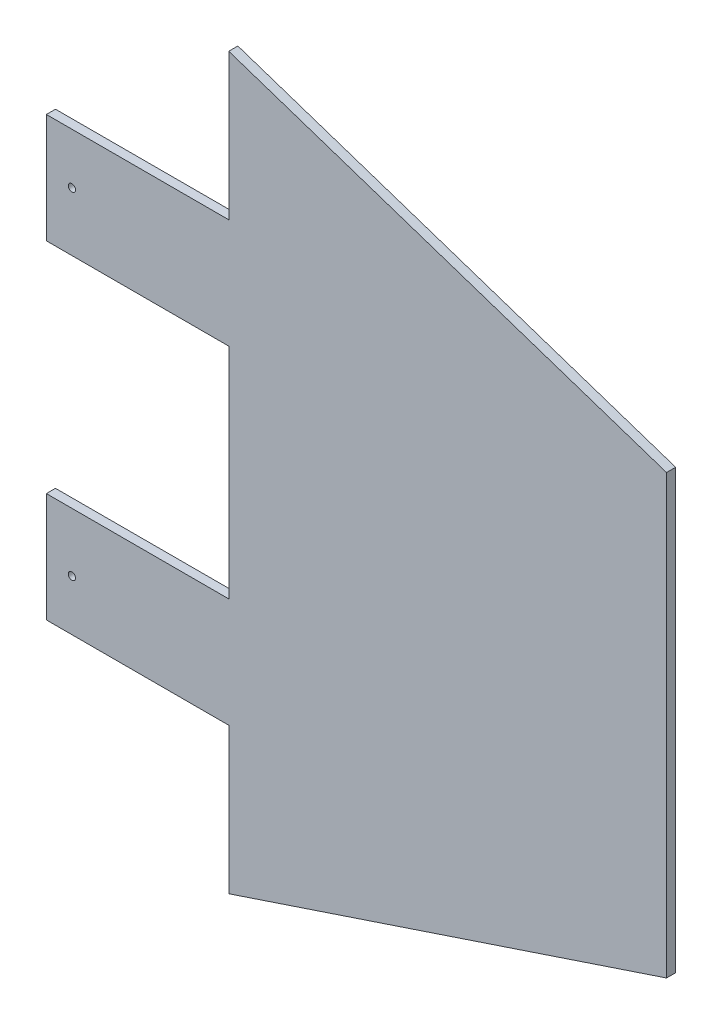
ISO-10303-21;
HEADER;
FILE_DESCRIPTION(('STEP AP214'),'2;1');
FILE_NAME('part.step','',(''),(''),'','','');
FILE_SCHEMA(('AUTOMOTIVE_DESIGN { 1 0 10303 214 1 1 1 1 }'));
ENDSEC;
DATA;
#1=APPLICATION_CONTEXT('core data for automotive mechanical design processes');
#2=APPLICATION_PROTOCOL_DEFINITION('international standard','automotive_design',2000,#1);
#3=PRODUCT_CONTEXT('',#1,'mechanical');
#4=PRODUCT('Part','Part','',(#3));
#5=PRODUCT_RELATED_PRODUCT_CATEGORY('part','',(#4));
#6=PRODUCT_DEFINITION_FORMATION('','',#4);
#7=PRODUCT_DEFINITION_CONTEXT('part definition',#1,'design');
#8=PRODUCT_DEFINITION('design','',#6,#7);
#9=PRODUCT_DEFINITION_SHAPE('','',#8);
#10=(LENGTH_UNIT() NAMED_UNIT(*) SI_UNIT(.MILLI.,.METRE.));
#11=(NAMED_UNIT(*) PLANE_ANGLE_UNIT() SI_UNIT($,.RADIAN.));
#12=(NAMED_UNIT(*) SI_UNIT($,.STERADIAN.) SOLID_ANGLE_UNIT());
#13=UNCERTAINTY_MEASURE_WITH_UNIT(LENGTH_MEASURE(1.E-05),#10,'distance_accuracy_value','');
#14=(GEOMETRIC_REPRESENTATION_CONTEXT(3) GLOBAL_UNCERTAINTY_ASSIGNED_CONTEXT((#13)) GLOBAL_UNIT_ASSIGNED_CONTEXT((#10,
#11,#12)) REPRESENTATION_CONTEXT('',''));
#15=CARTESIAN_POINT('',(0.,0.,0.));
#16=DIRECTION('',(0.,0.,1.));
#17=DIRECTION('',(1.,0.,0.));
#18=AXIS2_PLACEMENT_3D('',#15,#16,#17);
#19=CARTESIAN_POINT('',(0.,0.,-1.5875));
#20=DIRECTION('',(0.,0.,-1.));
#21=DIRECTION('',(-1.,0.,0.));
#22=AXIS2_PLACEMENT_3D('',#19,#20,#21);
#23=PLANE('',#22);
#24=CARTESIAN_POINT('',(40.64,-58.5125803294084,-1.5875));
#25=DIRECTION('',(0.,0.,-1.));
#26=DIRECTION('',(-1.,0.,0.));
#27=AXIS2_PLACEMENT_3D('',#24,#25,#26);
#28=CIRCLE('',#27,1.26619);
#29=CARTESIAN_POINT('',(39.37381,-58.5125803294084,-1.5875));
#30=VERTEX_POINT('',#29);
#31=EDGE_CURVE('E150',#30,#30,#28,.T.);
#32=ORIENTED_EDGE('',*,*,#31,.F.);
#33=EDGE_LOOP('',(#32));
#34=FACE_BOUND('',#33,.T.);
#35=DIRECTION('',(0.,-1.,0.));
#36=VECTOR('',#35,1.);
#37=CARTESIAN_POINT('',(95.2500000000001,127.,-1.5875));
#38=LINE('',#37,#36);
#39=CARTESIAN_POINT('',(95.2500000000001,127.,-1.5875));
#40=VERTEX_POINT('',#39);
#41=CARTESIAN_POINT('',(95.2500000000001,76.2,-1.5875));
#42=VERTEX_POINT('',#41);
#43=EDGE_CURVE('E125',#40,#42,#38,.T.);
#44=ORIENTED_EDGE('',*,*,#43,.F.);
#45=DIRECTION('',(-0.948683298050514,0.316227766016838,0.));
#46=VECTOR('',#45,1.);
#47=CARTESIAN_POINT('',(95.2500000000001,127.,-1.5875));
#48=LINE('',#47,#46);
#49=CARTESIAN_POINT('',(247.65,76.2,-1.5875));
#50=VERTEX_POINT('',#49);
#51=EDGE_CURVE('E130',#50,#40,#48,.T.);
#52=ORIENTED_EDGE('',*,*,#51,.F.);
#53=DIRECTION('',(0.,1.,0.));
#54=VECTOR('',#53,1.);
#55=CARTESIAN_POINT('',(247.65,76.2,-1.5875));
#56=LINE('',#55,#54);
#57=CARTESIAN_POINT('',(247.65,-76.2,-1.5875));
#58=VERTEX_POINT('',#57);
#59=EDGE_CURVE('E205',#58,#50,#56,.T.);
#60=ORIENTED_EDGE('',*,*,#59,.F.);
#61=DIRECTION('',(0.948683298050514,0.316227766016838,0.));
#62=VECTOR('',#61,1.);
#63=CARTESIAN_POINT('',(95.2500000000001,-127.,-1.5875));
#64=LINE('',#63,#62);
#65=CARTESIAN_POINT('',(95.2500000000001,-127.,-1.5875));
#66=VERTEX_POINT('',#65);
#67=EDGE_CURVE('E202',#66,#58,#64,.T.);
#68=ORIENTED_EDGE('',*,*,#67,.F.);
#69=DIRECTION('',(0.,-1.,0.));
#70=VECTOR('',#69,1.);
#71=CARTESIAN_POINT('',(95.2500000000001,-127.,-1.5875));
#72=LINE('',#71,#70);
#73=CARTESIAN_POINT('',(95.2500000000001,-76.2,-1.5875));
#74=VERTEX_POINT('',#73);
#75=EDGE_CURVE('E199',#74,#66,#72,.T.);
#76=ORIENTED_EDGE('',*,*,#75,.F.);
#77=DIRECTION('',(1.,0.,0.));
#78=VECTOR('',#77,1.);
#79=CARTESIAN_POINT('',(95.2500000000001,-76.2,-1.5875));
#80=LINE('',#79,#78);
#81=CARTESIAN_POINT('',(31.75,-76.2,-1.5875));
#82=VERTEX_POINT('',#81);
#83=EDGE_CURVE('E196',#82,#74,#80,.T.);
#84=ORIENTED_EDGE('',*,*,#83,.F.);
#85=DIRECTION('',(0.,-1.,0.));
#86=VECTOR('',#85,1.);
#87=CARTESIAN_POINT('',(31.75,-76.2,-1.5875));
#88=LINE('',#87,#86);
#89=CARTESIAN_POINT('',(31.75,-38.1,-1.5875));
#90=VERTEX_POINT('',#89);
#91=EDGE_CURVE('E193',#90,#82,#88,.T.);
#92=ORIENTED_EDGE('',*,*,#91,.F.);
#93=DIRECTION('',(-1.,0.,0.));
#94=VECTOR('',#93,1.);
#95=CARTESIAN_POINT('',(31.75,-38.1,-1.5875));
#96=LINE('',#95,#94);
#97=CARTESIAN_POINT('',(95.25,-38.1,-1.5875));
#98=VERTEX_POINT('',#97);
#99=EDGE_CURVE('E190',#98,#90,#96,.T.);
#100=ORIENTED_EDGE('',*,*,#99,.F.);
#101=DIRECTION('',(0.,-1.,0.));
#102=VECTOR('',#101,1.);
#103=CARTESIAN_POINT('',(95.25,38.1,-1.5875));
#104=LINE('',#103,#102);
#105=CARTESIAN_POINT('',(95.25,38.1,-1.5875));
#106=VERTEX_POINT('',#105);
#107=EDGE_CURVE('E187',#106,#98,#104,.T.);
#108=ORIENTED_EDGE('',*,*,#107,.F.);
#109=DIRECTION('',(1.,0.,0.));
#110=VECTOR('',#109,1.);
#111=CARTESIAN_POINT('',(31.75,38.1,-1.5875));
#112=LINE('',#111,#110);
#113=CARTESIAN_POINT('',(31.75,38.1,-1.5875));
#114=VERTEX_POINT('',#113);
#115=EDGE_CURVE('E184',#114,#106,#112,.T.);
#116=ORIENTED_EDGE('',*,*,#115,.F.);
#117=DIRECTION('',(0.,-1.,0.));
#118=VECTOR('',#117,1.);
#119=CARTESIAN_POINT('',(31.75,76.2,-1.5875));
#120=LINE('',#119,#118);
#121=CARTESIAN_POINT('',(31.75,76.2,-1.5875));
#122=VERTEX_POINT('',#121);
#123=EDGE_CURVE('E181',#122,#114,#120,.T.);
#124=ORIENTED_EDGE('',*,*,#123,.F.);
#125=DIRECTION('',(-1.,0.,0.));
#126=VECTOR('',#125,1.);
#127=CARTESIAN_POINT('',(95.2500000000001,76.2,-1.5875));
#128=LINE('',#127,#126);
#129=EDGE_CURVE('E179',#42,#122,#128,.T.);
#130=ORIENTED_EDGE('',*,*,#129,.F.);
#131=EDGE_LOOP('',(#44,#52,#60,#68,#76,#84,#92,#100,#108,#116,#124,#130));
#132=FACE_BOUND('',#131,.T.);
#133=CARTESIAN_POINT('',(40.64,58.5125803294083,-1.5875));
#134=DIRECTION('',(0.,0.,1.));
#135=DIRECTION('',(1.,0.,0.));
#136=AXIS2_PLACEMENT_3D('',#133,#134,#135);
#137=CIRCLE('',#136,1.26619);
#138=CARTESIAN_POINT('',(41.90619,58.5125803294083,-1.5875));
#139=VERTEX_POINT('',#138);
#140=EDGE_CURVE('E144',#139,#139,#137,.T.);
#141=ORIENTED_EDGE('',*,*,#140,.T.);
#142=EDGE_LOOP('',(#141));
#143=FACE_BOUND('',#142,.T.);
#144=ADVANCED_FACE('F35',(#34,#132,#143),#23,.T.);
#145=CARTESIAN_POINT('',(0.,0.,1.5875));
#146=DIRECTION('',(0.,0.,-1.));
#147=DIRECTION('',(-1.,0.,0.));
#148=AXIS2_PLACEMENT_3D('',#145,#146,#147);
#149=PLANE('',#148);
#150=DIRECTION('',(0.,-1.,0.));
#151=VECTOR('',#150,1.);
#152=CARTESIAN_POINT('',(95.2500000000001,127.,1.5875));
#153=LINE('',#152,#151);
#154=CARTESIAN_POINT('',(95.2500000000001,127.,1.5875));
#155=VERTEX_POINT('',#154);
#156=CARTESIAN_POINT('',(95.2500000000001,76.2,1.5875));
#157=VERTEX_POINT('',#156);
#158=EDGE_CURVE('E124',#155,#157,#153,.T.);
#159=ORIENTED_EDGE('',*,*,#158,.T.);
#160=DIRECTION('',(-1.,0.,0.));
#161=VECTOR('',#160,1.);
#162=CARTESIAN_POINT('',(95.2500000000001,76.2,1.5875));
#163=LINE('',#162,#161);
#164=CARTESIAN_POINT('',(31.75,76.2,1.5875));
#165=VERTEX_POINT('',#164);
#166=EDGE_CURVE('E132',#157,#165,#163,.T.);
#167=ORIENTED_EDGE('',*,*,#166,.T.);
#168=DIRECTION('',(0.,-1.,0.));
#169=VECTOR('',#168,1.);
#170=CARTESIAN_POINT('',(31.75,76.2,1.5875));
#171=LINE('',#170,#169);
#172=CARTESIAN_POINT('',(31.75,38.1,1.5875));
#173=VERTEX_POINT('',#172);
#174=EDGE_CURVE('E137',#165,#173,#171,.T.);
#175=ORIENTED_EDGE('',*,*,#174,.T.);
#176=DIRECTION('',(1.,0.,0.));
#177=VECTOR('',#176,1.);
#178=CARTESIAN_POINT('',(31.75,38.1,1.5875));
#179=LINE('',#178,#177);
#180=CARTESIAN_POINT('',(95.25,38.1,1.5875));
#181=VERTEX_POINT('',#180);
#182=EDGE_CURVE('E154',#173,#181,#179,.T.);
#183=ORIENTED_EDGE('',*,*,#182,.T.);
#184=DIRECTION('',(0.,-1.,0.));
#185=VECTOR('',#184,1.);
#186=CARTESIAN_POINT('',(95.25,38.1,1.5875));
#187=LINE('',#186,#185);
#188=CARTESIAN_POINT('',(95.25,-38.1,1.5875));
#189=VERTEX_POINT('',#188);
#190=EDGE_CURVE('E157',#181,#189,#187,.T.);
#191=ORIENTED_EDGE('',*,*,#190,.T.);
#192=DIRECTION('',(-1.,0.,0.));
#193=VECTOR('',#192,1.);
#194=CARTESIAN_POINT('',(31.75,-38.1,1.5875));
#195=LINE('',#194,#193);
#196=CARTESIAN_POINT('',(31.75,-38.1,1.5875));
#197=VERTEX_POINT('',#196);
#198=EDGE_CURVE('E160',#189,#197,#195,.T.);
#199=ORIENTED_EDGE('',*,*,#198,.T.);
#200=DIRECTION('',(0.,-1.,0.));
#201=VECTOR('',#200,1.);
#202=CARTESIAN_POINT('',(31.75,-76.2,1.5875));
#203=LINE('',#202,#201);
#204=CARTESIAN_POINT('',(31.75,-76.2,1.5875));
#205=VERTEX_POINT('',#204);
#206=EDGE_CURVE('E163',#197,#205,#203,.T.);
#207=ORIENTED_EDGE('',*,*,#206,.T.);
#208=DIRECTION('',(1.,0.,0.));
#209=VECTOR('',#208,1.);
#210=CARTESIAN_POINT('',(95.2500000000001,-76.2,1.5875));
#211=LINE('',#210,#209);
#212=CARTESIAN_POINT('',(95.2500000000001,-76.2,1.5875));
#213=VERTEX_POINT('',#212);
#214=EDGE_CURVE('E166',#205,#213,#211,.T.);
#215=ORIENTED_EDGE('',*,*,#214,.T.);
#216=DIRECTION('',(0.,-1.,0.));
#217=VECTOR('',#216,1.);
#218=CARTESIAN_POINT('',(95.2500000000001,-127.,1.5875));
#219=LINE('',#218,#217);
#220=CARTESIAN_POINT('',(95.2500000000001,-127.,1.5875));
#221=VERTEX_POINT('',#220);
#222=EDGE_CURVE('E169',#213,#221,#219,.T.);
#223=ORIENTED_EDGE('',*,*,#222,.T.);
#224=DIRECTION('',(0.948683298050514,0.316227766016838,0.));
#225=VECTOR('',#224,1.);
#226=CARTESIAN_POINT('',(95.2500000000001,-127.,1.5875));
#227=LINE('',#226,#225);
#228=CARTESIAN_POINT('',(247.65,-76.2,1.5875));
#229=VERTEX_POINT('',#228);
#230=EDGE_CURVE('E172',#221,#229,#227,.T.);
#231=ORIENTED_EDGE('',*,*,#230,.T.);
#232=DIRECTION('',(0.,1.,0.));
#233=VECTOR('',#232,1.);
#234=CARTESIAN_POINT('',(247.65,76.2,1.5875));
#235=LINE('',#234,#233);
#236=CARTESIAN_POINT('',(247.65,76.2,1.5875));
#237=VERTEX_POINT('',#236);
#238=EDGE_CURVE('E175',#229,#237,#235,.T.);
#239=ORIENTED_EDGE('',*,*,#238,.T.);
#240=DIRECTION('',(-0.948683298050514,0.316227766016838,0.));
#241=VECTOR('',#240,1.);
#242=CARTESIAN_POINT('',(95.2500000000001,127.,1.5875));
#243=LINE('',#242,#241);
#244=EDGE_CURVE('E143',#237,#155,#243,.T.);
#245=ORIENTED_EDGE('',*,*,#244,.T.);
#246=EDGE_LOOP('',(#159,#167,#175,#183,#191,#199,#207,#215,#223,#231,#239,#245));
#247=FACE_BOUND('',#246,.T.);
#248=CARTESIAN_POINT('',(40.64,-58.5125803294084,1.5875));
#249=DIRECTION('',(0.,0.,-1.));
#250=DIRECTION('',(-1.,0.,0.));
#251=AXIS2_PLACEMENT_3D('',#248,#249,#250);
#252=CIRCLE('',#251,1.26619);
#253=CARTESIAN_POINT('',(39.37381,-58.5125803294084,1.5875));
#254=VERTEX_POINT('',#253);
#255=EDGE_CURVE('E293',#254,#254,#252,.T.);
#256=ORIENTED_EDGE('',*,*,#255,.T.);
#257=EDGE_LOOP('',(#256));
#258=FACE_BOUND('',#257,.T.);
#259=CARTESIAN_POINT('',(40.64,58.5125803294083,1.5875));
#260=DIRECTION('',(0.,0.,1.));
#261=DIRECTION('',(1.,0.,0.));
#262=AXIS2_PLACEMENT_3D('',#259,#260,#261);
#263=CIRCLE('',#262,1.26619);
#264=CARTESIAN_POINT('',(41.90619,58.5125803294083,1.5875));
#265=VERTEX_POINT('',#264);
#266=EDGE_CURVE('E147',#265,#265,#263,.T.);
#267=ORIENTED_EDGE('',*,*,#266,.F.);
#268=EDGE_LOOP('',(#267));
#269=FACE_BOUND('',#268,.T.);
#270=ADVANCED_FACE('F140',(#247,#258,#269),#149,.F.);
#271=CARTESIAN_POINT('',(95.2500000000001,127.,-1.5875));
#272=DIRECTION('',(-1.,0.,0.));
#273=DIRECTION('',(0.,0.,1.));
#274=AXIS2_PLACEMENT_3D('',#271,#272,#273);
#275=PLANE('',#274);
#276=DIRECTION('',(0.,0.,1.));
#277=VECTOR('',#276,1.);
#278=CARTESIAN_POINT('',(95.2500000000001,76.2,-1.5875));
#279=LINE('',#278,#277);
#280=EDGE_CURVE('E39',#42,#157,#279,.T.);
#281=ORIENTED_EDGE('',*,*,#280,.T.);
#282=ORIENTED_EDGE('',*,*,#158,.F.);
#283=DIRECTION('',(0.,0.,1.));
#284=VECTOR('',#283,1.);
#285=CARTESIAN_POINT('',(95.2500000000001,127.,-1.5875));
#286=LINE('',#285,#284);
#287=EDGE_CURVE('E11',#40,#155,#286,.T.);
#288=ORIENTED_EDGE('',*,*,#287,.F.);
#289=ORIENTED_EDGE('',*,*,#43,.T.);
#290=EDGE_LOOP('',(#281,#282,#288,#289));
#291=FACE_BOUND('',#290,.T.);
#292=ADVANCED_FACE('F37',(#291),#275,.T.);
#293=CARTESIAN_POINT('',(95.2500000000001,127.,-1.5875));
#294=DIRECTION('',(0.316227766016838,0.948683298050514,0.));
#295=DIRECTION('',(-0.948683298050514,0.316227766016838,0.));
#296=AXIS2_PLACEMENT_3D('',#293,#294,#295);
#297=PLANE('',#296);
#298=ORIENTED_EDGE('',*,*,#287,.T.);
#299=ORIENTED_EDGE('',*,*,#244,.F.);
#300=DIRECTION('',(0.,0.,1.));
#301=VECTOR('',#300,1.);
#302=CARTESIAN_POINT('',(247.65,76.2,-1.5875));
#303=LINE('',#302,#301);
#304=EDGE_CURVE('E44',#50,#237,#303,.T.);
#305=ORIENTED_EDGE('',*,*,#304,.F.);
#306=ORIENTED_EDGE('',*,*,#51,.T.);
#307=EDGE_LOOP('',(#298,#299,#305,#306));
#308=FACE_BOUND('',#307,.T.);
#309=ADVANCED_FACE('F262',(#308),#297,.T.);
#310=CARTESIAN_POINT('',(247.65,76.2,-1.5875));
#311=DIRECTION('',(1.,0.,0.));
#312=DIRECTION('',(0.,0.,-1.));
#313=AXIS2_PLACEMENT_3D('',#310,#311,#312);
#314=PLANE('',#313);
#315=ORIENTED_EDGE('',*,*,#304,.T.);
#316=ORIENTED_EDGE('',*,*,#238,.F.);
#317=DIRECTION('',(0.,0.,1.));
#318=VECTOR('',#317,1.);
#319=CARTESIAN_POINT('',(247.65,-76.2,-1.5875));
#320=LINE('',#319,#318);
#321=EDGE_CURVE('E209',#58,#229,#320,.T.);
#322=ORIENTED_EDGE('',*,*,#321,.F.);
#323=ORIENTED_EDGE('',*,*,#59,.T.);
#324=EDGE_LOOP('',(#315,#316,#322,#323));
#325=FACE_BOUND('',#324,.T.);
#326=ADVANCED_FACE('F260',(#325),#314,.T.);
#327=CARTESIAN_POINT('',(95.2500000000001,-127.,-1.5875));
#328=DIRECTION('',(0.316227766016838,-0.948683298050514,0.));
#329=DIRECTION('',(0.948683298050514,0.316227766016838,0.));
#330=AXIS2_PLACEMENT_3D('',#327,#328,#329);
#331=PLANE('',#330);
#332=ORIENTED_EDGE('',*,*,#321,.T.);
#333=ORIENTED_EDGE('',*,*,#230,.F.);
#334=DIRECTION('',(0.,0.,1.));
#335=VECTOR('',#334,1.);
#336=CARTESIAN_POINT('',(95.2500000000001,-127.,-1.5875));
#337=LINE('',#336,#335);
#338=EDGE_CURVE('E211',#66,#221,#337,.T.);
#339=ORIENTED_EDGE('',*,*,#338,.F.);
#340=ORIENTED_EDGE('',*,*,#67,.T.);
#341=EDGE_LOOP('',(#332,#333,#339,#340));
#342=FACE_BOUND('',#341,.T.);
#343=ADVANCED_FACE('F258',(#342),#331,.T.);
#344=CARTESIAN_POINT('',(95.2500000000001,-127.,-1.5875));
#345=DIRECTION('',(-1.,0.,0.));
#346=DIRECTION('',(0.,0.,1.));
#347=AXIS2_PLACEMENT_3D('',#344,#345,#346);
#348=PLANE('',#347);
#349=ORIENTED_EDGE('',*,*,#338,.T.);
#350=ORIENTED_EDGE('',*,*,#222,.F.);
#351=DIRECTION('',(0.,0.,1.));
#352=VECTOR('',#351,1.);
#353=CARTESIAN_POINT('',(95.2500000000001,-76.2,-1.5875));
#354=LINE('',#353,#352);
#355=EDGE_CURVE('E213',#74,#213,#354,.T.);
#356=ORIENTED_EDGE('',*,*,#355,.F.);
#357=ORIENTED_EDGE('',*,*,#75,.T.);
#358=EDGE_LOOP('',(#349,#350,#356,#357));
#359=FACE_BOUND('',#358,.T.);
#360=ADVANCED_FACE('F253',(#359),#348,.T.);
#361=CARTESIAN_POINT('',(95.2500000000001,-76.2,-1.5875));
#362=DIRECTION('',(0.,-1.,0.));
#363=DIRECTION('',(1.,0.,0.));
#364=AXIS2_PLACEMENT_3D('',#361,#362,#363);
#365=PLANE('',#364);
#366=ORIENTED_EDGE('',*,*,#355,.T.);
#367=ORIENTED_EDGE('',*,*,#214,.F.);
#368=DIRECTION('',(0.,0.,1.));
#369=VECTOR('',#368,1.);
#370=CARTESIAN_POINT('',(31.75,-76.2,-1.5875));
#371=LINE('',#370,#369);
#372=EDGE_CURVE('E215',#82,#205,#371,.T.);
#373=ORIENTED_EDGE('',*,*,#372,.F.);
#374=ORIENTED_EDGE('',*,*,#83,.T.);
#375=EDGE_LOOP('',(#366,#367,#373,#374));
#376=FACE_BOUND('',#375,.T.);
#377=ADVANCED_FACE('F248',(#376),#365,.T.);
#378=CARTESIAN_POINT('',(31.75,-76.2,-1.5875));
#379=DIRECTION('',(-1.,0.,0.));
#380=DIRECTION('',(0.,-1.,0.));
#381=AXIS2_PLACEMENT_3D('',#378,#379,#380);
#382=PLANE('',#381);
#383=ORIENTED_EDGE('',*,*,#372,.T.);
#384=ORIENTED_EDGE('',*,*,#206,.F.);
#385=DIRECTION('',(0.,0.,1.));
#386=VECTOR('',#385,1.);
#387=CARTESIAN_POINT('',(31.75,-38.1,-1.5875));
#388=LINE('',#387,#386);
#389=EDGE_CURVE('E217',#90,#197,#388,.T.);
#390=ORIENTED_EDGE('',*,*,#389,.F.);
#391=ORIENTED_EDGE('',*,*,#91,.T.);
#392=EDGE_LOOP('',(#383,#384,#390,#391));
#393=FACE_BOUND('',#392,.T.);
#394=ADVANCED_FACE('F246',(#393),#382,.T.);
#395=CARTESIAN_POINT('',(31.75,-38.1,-1.5875));
#396=DIRECTION('',(0.,1.,0.));
#397=DIRECTION('',(0.,0.,1.));
#398=AXIS2_PLACEMENT_3D('',#395,#396,#397);
#399=PLANE('',#398);
#400=ORIENTED_EDGE('',*,*,#389,.T.);
#401=ORIENTED_EDGE('',*,*,#198,.F.);
#402=DIRECTION('',(0.,0.,1.));
#403=VECTOR('',#402,1.);
#404=CARTESIAN_POINT('',(95.25,-38.1,-1.5875));
#405=LINE('',#404,#403);
#406=EDGE_CURVE('E219',#98,#189,#405,.T.);
#407=ORIENTED_EDGE('',*,*,#406,.F.);
#408=ORIENTED_EDGE('',*,*,#99,.T.);
#409=EDGE_LOOP('',(#400,#401,#407,#408));
#410=FACE_BOUND('',#409,.T.);
#411=ADVANCED_FACE('F241',(#410),#399,.T.);
#412=CARTESIAN_POINT('',(95.25,38.1,-1.5875));
#413=DIRECTION('',(-1.,0.,0.));
#414=DIRECTION('',(0.,0.,1.));
#415=AXIS2_PLACEMENT_3D('',#412,#413,#414);
#416=PLANE('',#415);
#417=ORIENTED_EDGE('',*,*,#406,.T.);
#418=ORIENTED_EDGE('',*,*,#190,.F.);
#419=DIRECTION('',(0.,0.,1.));
#420=VECTOR('',#419,1.);
#421=CARTESIAN_POINT('',(95.25,38.1,-1.5875));
#422=LINE('',#421,#420);
#423=EDGE_CURVE('E221',#106,#181,#422,.T.);
#424=ORIENTED_EDGE('',*,*,#423,.F.);
#425=ORIENTED_EDGE('',*,*,#107,.T.);
#426=EDGE_LOOP('',(#417,#418,#424,#425));
#427=FACE_BOUND('',#426,.T.);
#428=ADVANCED_FACE('F234',(#427),#416,.T.);
#429=CARTESIAN_POINT('',(31.75,38.1,-1.5875));
#430=DIRECTION('',(0.,-1.,0.));
#431=DIRECTION('',(0.,0.,-1.));
#432=AXIS2_PLACEMENT_3D('',#429,#430,#431);
#433=PLANE('',#432);
#434=ORIENTED_EDGE('',*,*,#423,.T.);
#435=ORIENTED_EDGE('',*,*,#182,.F.);
#436=DIRECTION('',(0.,0.,1.));
#437=VECTOR('',#436,1.);
#438=CARTESIAN_POINT('',(31.75,38.1,-1.5875));
#439=LINE('',#438,#437);
#440=EDGE_CURVE('E223',#114,#173,#439,.T.);
#441=ORIENTED_EDGE('',*,*,#440,.F.);
#442=ORIENTED_EDGE('',*,*,#115,.T.);
#443=EDGE_LOOP('',(#434,#435,#441,#442));
#444=FACE_BOUND('',#443,.T.);
#445=ADVANCED_FACE('F231',(#444),#433,.T.);
#446=CARTESIAN_POINT('',(31.75,76.2,-1.5875));
#447=DIRECTION('',(-1.,0.,0.));
#448=DIRECTION('',(0.,-1.,0.));
#449=AXIS2_PLACEMENT_3D('',#446,#447,#448);
#450=PLANE('',#449);
#451=ORIENTED_EDGE('',*,*,#440,.T.);
#452=ORIENTED_EDGE('',*,*,#174,.F.);
#453=DIRECTION('',(0.,0.,1.));
#454=VECTOR('',#453,1.);
#455=CARTESIAN_POINT('',(31.75,76.2,-1.5875));
#456=LINE('',#455,#454);
#457=EDGE_CURVE('E129',#122,#165,#456,.T.);
#458=ORIENTED_EDGE('',*,*,#457,.F.);
#459=ORIENTED_EDGE('',*,*,#123,.T.);
#460=EDGE_LOOP('',(#451,#452,#458,#459));
#461=FACE_BOUND('',#460,.T.);
#462=ADVANCED_FACE('F225',(#461),#450,.T.);
#463=CARTESIAN_POINT('',(95.2500000000001,76.2,-1.5875));
#464=DIRECTION('',(0.,1.,0.));
#465=DIRECTION('',(-1.,0.,0.));
#466=AXIS2_PLACEMENT_3D('',#463,#464,#465);
#467=PLANE('',#466);
#468=ORIENTED_EDGE('',*,*,#457,.T.);
#469=ORIENTED_EDGE('',*,*,#166,.F.);
#470=ORIENTED_EDGE('',*,*,#280,.F.);
#471=ORIENTED_EDGE('',*,*,#129,.T.);
#472=EDGE_LOOP('',(#468,#469,#470,#471));
#473=FACE_BOUND('',#472,.T.);
#474=ADVANCED_FACE('F133',(#473),#467,.T.);
#475=CARTESIAN_POINT('',(40.64,-58.5125803294084,-1.5875));
#476=DIRECTION('',(0.,0.,1.));
#477=DIRECTION('',(1.,0.,0.));
#478=AXIS2_PLACEMENT_3D('',#475,#476,#477);
#479=CYLINDRICAL_SURFACE('',#478,1.26619);
#480=ORIENTED_EDGE('',*,*,#31,.T.);
#481=EDGE_LOOP('',(#480));
#482=FACE_BOUND('',#481,.T.);
#483=ORIENTED_EDGE('',*,*,#255,.F.);
#484=EDGE_LOOP('',(#483));
#485=FACE_BOUND('',#484,.T.);
#486=ADVANCED_FACE('F279',(#482,#485),#479,.F.);
#487=CARTESIAN_POINT('',(40.64,58.5125803294083,-1.5875));
#488=DIRECTION('',(0.,0.,1.));
#489=DIRECTION('',(1.,0.,0.));
#490=AXIS2_PLACEMENT_3D('',#487,#488,#489);
#491=CYLINDRICAL_SURFACE('',#490,1.26619);
#492=ORIENTED_EDGE('',*,*,#140,.F.);
#493=EDGE_LOOP('',(#492));
#494=FACE_BOUND('',#493,.T.);
#495=ORIENTED_EDGE('',*,*,#266,.T.);
#496=EDGE_LOOP('',(#495));
#497=FACE_BOUND('',#496,.T.);
#498=ADVANCED_FACE('F282',(#494,#497),#491,.F.);
#499=CLOSED_SHELL('',(#144,#270,#292,#309,#326,#343,#360,#377,#394,#411,#428,#445,#462,#474,
#486,#498));
#500=MANIFOLD_SOLID_BREP('B2',#499);
#501=ADVANCED_BREP_SHAPE_REPRESENTATION('',(#18,#500),#14);
#502=SHAPE_DEFINITION_REPRESENTATION(#9,#501);
ENDSEC;
END-ISO-10303-21;
